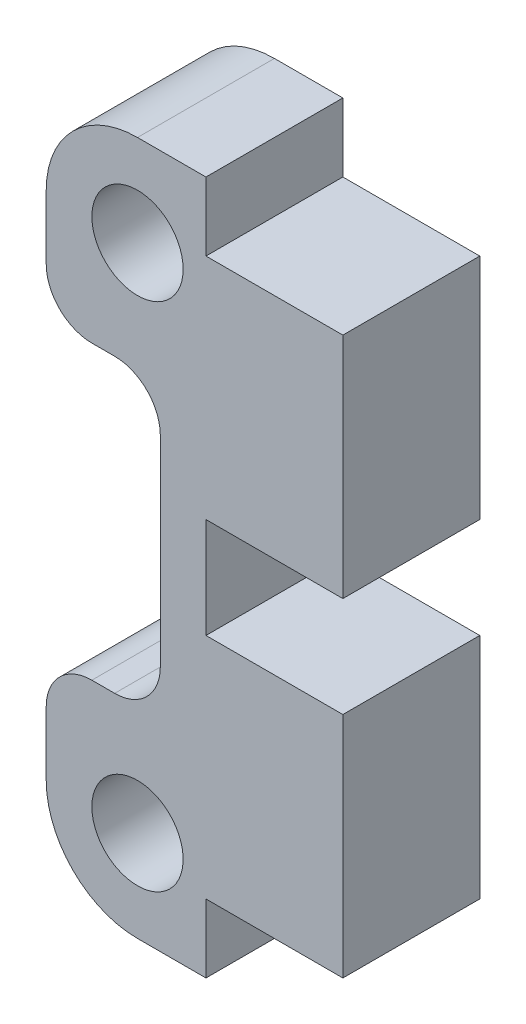
ISO-10303-21;
HEADER;
FILE_DESCRIPTION(('STEP AP214'),'2;1');
FILE_NAME('part.step','',(''),(''),'','','');
FILE_SCHEMA(('AUTOMOTIVE_DESIGN { 1 0 10303 214 1 1 1 1 }'));
ENDSEC;
DATA;
#1=APPLICATION_CONTEXT('core data for automotive mechanical design processes');
#2=APPLICATION_PROTOCOL_DEFINITION('international standard','automotive_design',2000,#1);
#3=PRODUCT_CONTEXT('',#1,'mechanical');
#4=PRODUCT('Part','Part','',(#3));
#5=PRODUCT_RELATED_PRODUCT_CATEGORY('part','',(#4));
#6=PRODUCT_DEFINITION_FORMATION('','',#4);
#7=PRODUCT_DEFINITION_CONTEXT('part definition',#1,'design');
#8=PRODUCT_DEFINITION('design','',#6,#7);
#9=PRODUCT_DEFINITION_SHAPE('','',#8);
#10=(LENGTH_UNIT() NAMED_UNIT(*) SI_UNIT(.MILLI.,.METRE.));
#11=(NAMED_UNIT(*) PLANE_ANGLE_UNIT() SI_UNIT($,.RADIAN.));
#12=(NAMED_UNIT(*) SI_UNIT($,.STERADIAN.) SOLID_ANGLE_UNIT());
#13=UNCERTAINTY_MEASURE_WITH_UNIT(LENGTH_MEASURE(1.E-05),#10,'distance_accuracy_value','');
#14=(GEOMETRIC_REPRESENTATION_CONTEXT(3) GLOBAL_UNCERTAINTY_ASSIGNED_CONTEXT((#13)) GLOBAL_UNIT_ASSIGNED_CONTEXT((#10,
#11,#12)) REPRESENTATION_CONTEXT('',''));
#15=CARTESIAN_POINT('',(0.,0.,0.));
#16=DIRECTION('',(0.,0.,1.));
#17=DIRECTION('',(1.,0.,0.));
#18=AXIS2_PLACEMENT_3D('',#15,#16,#17);
#19=CARTESIAN_POINT('',(-8.9997392156855,11.2,6.));
#20=DIRECTION('',(0.,0.,-1.));
#21=DIRECTION('',(-1.,0.,0.));
#22=AXIS2_PLACEMENT_3D('',#19,#20,#21);
#23=PLANE('',#22);
#24=DIRECTION('',(1.,-3.32597357193477E-12,0.));
#25=VECTOR('',#24,1.);
#26=CARTESIAN_POINT('',(0.,2.2,6.));
#27=LINE('',#26,#25);
#28=CARTESIAN_POINT('',(-5.9997392156855,2.2,6.));
#29=VERTEX_POINT('',#28);
#30=CARTESIAN_POINT('',(0.00026078431449787,2.2,6.));
#31=VERTEX_POINT('',#30);
#32=EDGE_CURVE('E50',#29,#31,#27,.T.);
#33=ORIENTED_EDGE('',*,*,#32,.T.);
#34=DIRECTION('',(0.,1.,0.));
#35=VECTOR('',#34,1.);
#36=CARTESIAN_POINT('',(0.00026078431449787,2.2,6.));
#37=LINE('',#36,#35);
#38=CARTESIAN_POINT('',(0.00026078431449787,12.2,6.));
#39=VERTEX_POINT('',#38);
#40=EDGE_CURVE('E135',#31,#39,#37,.T.);
#41=ORIENTED_EDGE('',*,*,#40,.T.);
#42=DIRECTION('',(-1.,0.,0.));
#43=VECTOR('',#42,1.);
#44=CARTESIAN_POINT('',(0.00026078431449787,12.2,6.));
#45=LINE('',#44,#43);
#46=CARTESIAN_POINT('',(-5.9997392156855,12.2,6.));
#47=VERTEX_POINT('',#46);
#48=EDGE_CURVE('E316',#39,#47,#45,.T.);
#49=ORIENTED_EDGE('',*,*,#48,.T.);
#50=DIRECTION('',(0.,1.,0.));
#51=VECTOR('',#50,1.);
#52=CARTESIAN_POINT('',(-5.9997392156855,12.2,6.));
#53=LINE('',#52,#51);
#54=CARTESIAN_POINT('',(-5.9997392156855,15.2,6.));
#55=VERTEX_POINT('',#54);
#56=EDGE_CURVE('E336',#47,#55,#53,.T.);
#57=ORIENTED_EDGE('',*,*,#56,.T.);
#58=DIRECTION('',(-1.,0.,0.));
#59=VECTOR('',#58,1.);
#60=CARTESIAN_POINT('',(-8.9997392156855,15.2,6.));
#61=LINE('',#60,#59);
#62=CARTESIAN_POINT('',(-8.9997392156855,15.2,6.));
#63=VERTEX_POINT('',#62);
#64=EDGE_CURVE('E333',#55,#63,#61,.T.);
#65=ORIENTED_EDGE('',*,*,#64,.T.);
#66=CARTESIAN_POINT('',(-8.9997392156855,11.2,6.));
#67=DIRECTION('',(0.,0.,1.));
#68=DIRECTION('',(-1.,0.,0.));
#69=AXIS2_PLACEMENT_3D('',#66,#67,#68);
#70=CIRCLE('',#69,4.);
#71=CARTESIAN_POINT('',(-12.9997392156855,11.2,6.));
#72=VERTEX_POINT('',#71);
#73=EDGE_CURVE('E335',#63,#72,#70,.T.);
#74=ORIENTED_EDGE('',*,*,#73,.T.);
#75=DIRECTION('',(0.,-1.,0.));
#76=VECTOR('',#75,1.);
#77=CARTESIAN_POINT('',(-12.9997392156855,11.2,6.));
#78=LINE('',#77,#76);
#79=CARTESIAN_POINT('',(-12.9997392156855,8.39638009049773,6.));
#80=VERTEX_POINT('',#79);
#81=EDGE_CURVE('E338',#72,#80,#78,.T.);
#82=ORIENTED_EDGE('',*,*,#81,.T.);
#83=CARTESIAN_POINT('',(-10.9997392156855,8.39638009049773,6.));
#84=DIRECTION('',(0.,0.,1.));
#85=DIRECTION('',(1.,0.,0.));
#86=AXIS2_PLACEMENT_3D('',#83,#84,#85);
#87=CIRCLE('',#86,2.);
#88=CARTESIAN_POINT('',(-10.9997392156855,6.39638009049773,6.));
#89=VERTEX_POINT('',#88);
#90=EDGE_CURVE('E344',#80,#89,#87,.T.);
#91=ORIENTED_EDGE('',*,*,#90,.T.);
#92=DIRECTION('',(1.,0.,0.));
#93=VECTOR('',#92,1.);
#94=CARTESIAN_POINT('',(-10.9997392156855,6.39638009049773,6.));
#95=LINE('',#94,#93);
#96=CARTESIAN_POINT('',(-10.,6.39638009049773,6.));
#97=VERTEX_POINT('',#96);
#98=EDGE_CURVE('E346',#89,#97,#95,.T.);
#99=ORIENTED_EDGE('',*,*,#98,.T.);
#100=CARTESIAN_POINT('',(-10.,4.39638009049773,6.));
#101=DIRECTION('',(0.,0.,-1.));
#102=DIRECTION('',(-1.,0.,0.));
#103=AXIS2_PLACEMENT_3D('',#100,#101,#102);
#104=CIRCLE('',#103,2.);
#105=CARTESIAN_POINT('',(-8.,4.39638009049772,6.));
#106=VERTEX_POINT('',#105);
#107=EDGE_CURVE('E348',#97,#106,#104,.T.);
#108=ORIENTED_EDGE('',*,*,#107,.T.);
#109=DIRECTION('',(0.,-1.,0.));
#110=VECTOR('',#109,1.);
#111=CARTESIAN_POINT('',(-8.,4.39638009049772,6.));
#112=LINE('',#111,#110);
#113=CARTESIAN_POINT('',(-8.,-4.39638009049772,6.));
#114=VERTEX_POINT('',#113);
#115=EDGE_CURVE('E350',#106,#114,#112,.T.);
#116=ORIENTED_EDGE('',*,*,#115,.T.);
#117=CARTESIAN_POINT('',(-10.,-4.39638009049773,6.));
#118=DIRECTION('',(0.,0.,-1.));
#119=DIRECTION('',(1.,0.,0.));
#120=AXIS2_PLACEMENT_3D('',#117,#118,#119);
#121=CIRCLE('',#120,2.);
#122=CARTESIAN_POINT('',(-10.,-6.39638009049773,6.));
#123=VERTEX_POINT('',#122);
#124=EDGE_CURVE('E352',#114,#123,#121,.T.);
#125=ORIENTED_EDGE('',*,*,#124,.T.);
#126=DIRECTION('',(-1.,0.,0.));
#127=VECTOR('',#126,1.);
#128=CARTESIAN_POINT('',(-10.9997392156855,-6.39638009049773,6.));
#129=LINE('',#128,#127);
#130=CARTESIAN_POINT('',(-10.9997392156855,-6.39638009049773,6.));
#131=VERTEX_POINT('',#130);
#132=EDGE_CURVE('E354',#123,#131,#129,.T.);
#133=ORIENTED_EDGE('',*,*,#132,.T.);
#134=CARTESIAN_POINT('',(-10.9997392156855,-8.39638009049773,6.));
#135=DIRECTION('',(0.,0.,1.));
#136=DIRECTION('',(-1.,0.,0.));
#137=AXIS2_PLACEMENT_3D('',#134,#135,#136);
#138=CIRCLE('',#137,2.);
#139=CARTESIAN_POINT('',(-12.9997392156855,-8.39638009049773,6.));
#140=VERTEX_POINT('',#139);
#141=EDGE_CURVE('E356',#131,#140,#138,.T.);
#142=ORIENTED_EDGE('',*,*,#141,.T.);
#143=DIRECTION('',(0.,-1.,0.));
#144=VECTOR('',#143,1.);
#145=CARTESIAN_POINT('',(-12.9997392156855,-11.2,6.));
#146=LINE('',#145,#144);
#147=CARTESIAN_POINT('',(-12.9997392156855,-11.2,6.));
#148=VERTEX_POINT('',#147);
#149=EDGE_CURVE('E358',#140,#148,#146,.T.);
#150=ORIENTED_EDGE('',*,*,#149,.T.);
#151=CARTESIAN_POINT('',(-8.9997392156855,-11.2,6.));
#152=DIRECTION('',(0.,0.,1.));
#153=DIRECTION('',(1.,0.,0.));
#154=AXIS2_PLACEMENT_3D('',#151,#152,#153);
#155=CIRCLE('',#154,4.);
#156=CARTESIAN_POINT('',(-8.9997392156855,-15.2,6.));
#157=VERTEX_POINT('',#156);
#158=EDGE_CURVE('E360',#148,#157,#155,.T.);
#159=ORIENTED_EDGE('',*,*,#158,.T.);
#160=DIRECTION('',(1.,0.,0.));
#161=VECTOR('',#160,1.);
#162=CARTESIAN_POINT('',(-8.9997392156855,-15.2,6.));
#163=LINE('',#162,#161);
#164=CARTESIAN_POINT('',(-5.9997392156855,-15.2,6.));
#165=VERTEX_POINT('',#164);
#166=EDGE_CURVE('E362',#157,#165,#163,.T.);
#167=ORIENTED_EDGE('',*,*,#166,.T.);
#168=DIRECTION('',(0.,1.,0.));
#169=VECTOR('',#168,1.);
#170=CARTESIAN_POINT('',(-5.9997392156855,-12.2,6.));
#171=LINE('',#170,#169);
#172=CARTESIAN_POINT('',(-5.9997392156855,-12.2,6.));
#173=VERTEX_POINT('',#172);
#174=EDGE_CURVE('E364',#165,#173,#171,.T.);
#175=ORIENTED_EDGE('',*,*,#174,.T.);
#176=DIRECTION('',(1.,0.,0.));
#177=VECTOR('',#176,1.);
#178=CARTESIAN_POINT('',(0.00026078431449787,-12.2,6.));
#179=LINE('',#178,#177);
#180=CARTESIAN_POINT('',(0.00026078431449787,-12.2,6.));
#181=VERTEX_POINT('',#180);
#182=EDGE_CURVE('E197',#173,#181,#179,.T.);
#183=ORIENTED_EDGE('',*,*,#182,.T.);
#184=DIRECTION('',(0.,1.,0.));
#185=VECTOR('',#184,1.);
#186=CARTESIAN_POINT('',(0.00026078431449787,-2.2,6.));
#187=LINE('',#186,#185);
#188=CARTESIAN_POINT('',(0.00026078431449787,-2.2,6.));
#189=VERTEX_POINT('',#188);
#190=EDGE_CURVE('E191',#181,#189,#187,.T.);
#191=ORIENTED_EDGE('',*,*,#190,.T.);
#192=DIRECTION('',(-1.,-3.32597357193477E-12,0.));
#193=VECTOR('',#192,1.);
#194=CARTESIAN_POINT('',(0.,-2.2,6.));
#195=LINE('',#194,#193);
#196=CARTESIAN_POINT('',(-5.9997392156855,-2.2,6.));
#197=VERTEX_POINT('',#196);
#198=EDGE_CURVE('E195',#189,#197,#195,.T.);
#199=ORIENTED_EDGE('',*,*,#198,.T.);
#200=DIRECTION('',(0.,1.,0.));
#201=VECTOR('',#200,1.);
#202=CARTESIAN_POINT('',(-5.9997392156855,2.2,6.));
#203=LINE('',#202,#201);
#204=EDGE_CURVE('E212',#197,#29,#203,.T.);
#205=ORIENTED_EDGE('',*,*,#204,.T.);
#206=EDGE_LOOP('',(#33,#41,#49,#57,#65,#74,#82,#91,#99,#108,#116,#125,#133,#142,#150,#159,#167,
#175,#183,#191,#199,#205));
#207=FACE_BOUND('',#206,.T.);
#208=CARTESIAN_POINT('',(-8.9997392156855,11.2,6.));
#209=DIRECTION('',(0.,0.,1.));
#210=DIRECTION('',(1.,0.,0.));
#211=AXIS2_PLACEMENT_3D('',#208,#209,#210);
#212=CIRCLE('',#211,2.);
#213=CARTESIAN_POINT('',(-6.9997392156855,11.2,6.));
#214=VERTEX_POINT('',#213);
#215=EDGE_CURVE('E221',#214,#214,#212,.T.);
#216=ORIENTED_EDGE('',*,*,#215,.F.);
#217=EDGE_LOOP('',(#216));
#218=FACE_BOUND('',#217,.T.);
#219=CARTESIAN_POINT('',(-8.9997392156855,-11.2,6.));
#220=DIRECTION('',(0.,0.,1.));
#221=DIRECTION('',(-1.,0.,0.));
#222=AXIS2_PLACEMENT_3D('',#219,#220,#221);
#223=CIRCLE('',#222,2.);
#224=CARTESIAN_POINT('',(-10.9997392156855,-11.2,6.));
#225=VERTEX_POINT('',#224);
#226=EDGE_CURVE('E383',#225,#225,#223,.T.);
#227=ORIENTED_EDGE('',*,*,#226,.F.);
#228=EDGE_LOOP('',(#227));
#229=FACE_BOUND('',#228,.T.);
#230=ADVANCED_FACE('F33',(#207,#218,#229),#23,.F.);
#231=CARTESIAN_POINT('',(-8.9997392156855,11.2,0.));
#232=DIRECTION('',(0.,0.,-1.));
#233=DIRECTION('',(-1.,0.,0.));
#234=AXIS2_PLACEMENT_3D('',#231,#232,#233);
#235=PLANE('',#234);
#236=CARTESIAN_POINT('',(-8.9997392156855,11.2,0.));
#237=DIRECTION('',(0.,0.,1.));
#238=DIRECTION('',(1.,0.,0.));
#239=AXIS2_PLACEMENT_3D('',#236,#237,#238);
#240=CIRCLE('',#239,2.);
#241=CARTESIAN_POINT('',(-6.9997392156855,11.2,0.));
#242=VERTEX_POINT('',#241);
#243=EDGE_CURVE('E380',#242,#242,#240,.T.);
#244=ORIENTED_EDGE('',*,*,#243,.T.);
#245=EDGE_LOOP('',(#244));
#246=FACE_BOUND('',#245,.T.);
#247=DIRECTION('',(0.,1.,0.));
#248=VECTOR('',#247,1.);
#249=CARTESIAN_POINT('',(0.00026078431449787,2.2,0.));
#250=LINE('',#249,#248);
#251=CARTESIAN_POINT('',(0.00026078431449787,2.2,0.));
#252=VERTEX_POINT('',#251);
#253=CARTESIAN_POINT('',(0.00026078431449787,12.2,0.));
#254=VERTEX_POINT('',#253);
#255=EDGE_CURVE('E218',#252,#254,#250,.T.);
#256=ORIENTED_EDGE('',*,*,#255,.F.);
#257=DIRECTION('',(1.,0.,0.));
#258=VECTOR('',#257,1.);
#259=CARTESIAN_POINT('',(0.,2.2,0.));
#260=LINE('',#259,#258);
#261=CARTESIAN_POINT('',(-5.9997392156855,2.2,0.));
#262=VERTEX_POINT('',#261);
#263=EDGE_CURVE('E258',#262,#252,#260,.T.);
#264=ORIENTED_EDGE('',*,*,#263,.F.);
#265=DIRECTION('',(0.,1.,0.));
#266=VECTOR('',#265,1.);
#267=CARTESIAN_POINT('',(-5.9997392156855,2.2,0.));
#268=LINE('',#267,#266);
#269=CARTESIAN_POINT('',(-5.9997392156855,-2.2,0.));
#270=VERTEX_POINT('',#269);
#271=EDGE_CURVE('E128',#270,#262,#268,.T.);
#272=ORIENTED_EDGE('',*,*,#271,.F.);
#273=DIRECTION('',(-1.,0.,0.));
#274=VECTOR('',#273,1.);
#275=CARTESIAN_POINT('',(0.,-2.2,0.));
#276=LINE('',#275,#274);
#277=CARTESIAN_POINT('',(0.00026078431449787,-2.2,0.));
#278=VERTEX_POINT('',#277);
#279=EDGE_CURVE('E121',#278,#270,#276,.T.);
#280=ORIENTED_EDGE('',*,*,#279,.F.);
#281=DIRECTION('',(0.,1.,0.));
#282=VECTOR('',#281,1.);
#283=CARTESIAN_POINT('',(0.00026078431449787,-2.2,0.));
#284=LINE('',#283,#282);
#285=CARTESIAN_POINT('',(0.00026078431449787,-12.2,0.));
#286=VERTEX_POINT('',#285);
#287=EDGE_CURVE('E206',#286,#278,#284,.T.);
#288=ORIENTED_EDGE('',*,*,#287,.F.);
#289=DIRECTION('',(1.,0.,0.));
#290=VECTOR('',#289,1.);
#291=CARTESIAN_POINT('',(0.00026078431449787,-12.2,0.));
#292=LINE('',#291,#290);
#293=CARTESIAN_POINT('',(-5.9997392156855,-12.2,0.));
#294=VERTEX_POINT('',#293);
#295=EDGE_CURVE('E253',#294,#286,#292,.T.);
#296=ORIENTED_EDGE('',*,*,#295,.F.);
#297=DIRECTION('',(0.,1.,0.));
#298=VECTOR('',#297,1.);
#299=CARTESIAN_POINT('',(-5.9997392156855,-12.2,0.));
#300=LINE('',#299,#298);
#301=CARTESIAN_POINT('',(-5.9997392156855,-15.2,0.));
#302=VERTEX_POINT('',#301);
#303=EDGE_CURVE('E251',#302,#294,#300,.T.);
#304=ORIENTED_EDGE('',*,*,#303,.F.);
#305=DIRECTION('',(1.,0.,0.));
#306=VECTOR('',#305,1.);
#307=CARTESIAN_POINT('',(-8.9997392156855,-15.2,0.));
#308=LINE('',#307,#306);
#309=CARTESIAN_POINT('',(-8.9997392156855,-15.2,0.));
#310=VERTEX_POINT('',#309);
#311=EDGE_CURVE('E249',#310,#302,#308,.T.);
#312=ORIENTED_EDGE('',*,*,#311,.F.);
#313=CARTESIAN_POINT('',(-8.9997392156855,-11.2,0.));
#314=DIRECTION('',(0.,0.,1.));
#315=DIRECTION('',(1.,0.,0.));
#316=AXIS2_PLACEMENT_3D('',#313,#314,#315);
#317=CIRCLE('',#316,4.);
#318=CARTESIAN_POINT('',(-12.9997392156855,-11.2,0.));
#319=VERTEX_POINT('',#318);
#320=EDGE_CURVE('E247',#319,#310,#317,.T.);
#321=ORIENTED_EDGE('',*,*,#320,.F.);
#322=DIRECTION('',(0.,-1.,0.));
#323=VECTOR('',#322,1.);
#324=CARTESIAN_POINT('',(-12.9997392156855,-11.2,0.));
#325=LINE('',#324,#323);
#326=CARTESIAN_POINT('',(-12.9997392156855,-8.39638009049773,0.));
#327=VERTEX_POINT('',#326);
#328=EDGE_CURVE('E245',#327,#319,#325,.T.);
#329=ORIENTED_EDGE('',*,*,#328,.F.);
#330=CARTESIAN_POINT('',(-10.9997392156855,-8.39638009049773,0.));
#331=DIRECTION('',(0.,0.,1.));
#332=DIRECTION('',(-1.,0.,0.));
#333=AXIS2_PLACEMENT_3D('',#330,#331,#332);
#334=CIRCLE('',#333,2.);
#335=CARTESIAN_POINT('',(-10.9997392156855,-6.39638009049773,0.));
#336=VERTEX_POINT('',#335);
#337=EDGE_CURVE('E243',#336,#327,#334,.T.);
#338=ORIENTED_EDGE('',*,*,#337,.F.);
#339=DIRECTION('',(-1.,0.,0.));
#340=VECTOR('',#339,1.);
#341=CARTESIAN_POINT('',(-10.9997392156855,-6.39638009049773,0.));
#342=LINE('',#341,#340);
#343=CARTESIAN_POINT('',(-10.,-6.39638009049773,0.));
#344=VERTEX_POINT('',#343);
#345=EDGE_CURVE('E241',#344,#336,#342,.T.);
#346=ORIENTED_EDGE('',*,*,#345,.F.);
#347=CARTESIAN_POINT('',(-10.,-4.39638009049773,0.));
#348=DIRECTION('',(0.,0.,-1.));
#349=DIRECTION('',(1.,0.,0.));
#350=AXIS2_PLACEMENT_3D('',#347,#348,#349);
#351=CIRCLE('',#350,2.);
#352=CARTESIAN_POINT('',(-8.,-4.39638009049772,0.));
#353=VERTEX_POINT('',#352);
#354=EDGE_CURVE('E239',#353,#344,#351,.T.);
#355=ORIENTED_EDGE('',*,*,#354,.F.);
#356=DIRECTION('',(0.,-1.,0.));
#357=VECTOR('',#356,1.);
#358=CARTESIAN_POINT('',(-8.,4.39638009049772,0.));
#359=LINE('',#358,#357);
#360=CARTESIAN_POINT('',(-8.,4.39638009049772,0.));
#361=VERTEX_POINT('',#360);
#362=EDGE_CURVE('E237',#361,#353,#359,.T.);
#363=ORIENTED_EDGE('',*,*,#362,.F.);
#364=CARTESIAN_POINT('',(-10.,4.39638009049773,0.));
#365=DIRECTION('',(0.,0.,-1.));
#366=DIRECTION('',(-1.,0.,0.));
#367=AXIS2_PLACEMENT_3D('',#364,#365,#366);
#368=CIRCLE('',#367,2.);
#369=CARTESIAN_POINT('',(-10.,6.39638009049773,0.));
#370=VERTEX_POINT('',#369);
#371=EDGE_CURVE('E235',#370,#361,#368,.T.);
#372=ORIENTED_EDGE('',*,*,#371,.F.);
#373=DIRECTION('',(1.,0.,0.));
#374=VECTOR('',#373,1.);
#375=CARTESIAN_POINT('',(-10.9997392156855,6.39638009049773,0.));
#376=LINE('',#375,#374);
#377=CARTESIAN_POINT('',(-10.9997392156855,6.39638009049773,0.));
#378=VERTEX_POINT('',#377);
#379=EDGE_CURVE('E233',#378,#370,#376,.T.);
#380=ORIENTED_EDGE('',*,*,#379,.F.);
#381=CARTESIAN_POINT('',(-10.9997392156855,8.39638009049773,0.));
#382=DIRECTION('',(0.,0.,1.));
#383=DIRECTION('',(1.,0.,0.));
#384=AXIS2_PLACEMENT_3D('',#381,#382,#383);
#385=CIRCLE('',#384,2.);
#386=CARTESIAN_POINT('',(-12.9997392156855,8.39638009049773,0.));
#387=VERTEX_POINT('',#386);
#388=EDGE_CURVE('E231',#387,#378,#385,.T.);
#389=ORIENTED_EDGE('',*,*,#388,.F.);
#390=DIRECTION('',(0.,-1.,0.));
#391=VECTOR('',#390,1.);
#392=CARTESIAN_POINT('',(-12.9997392156855,11.2,0.));
#393=LINE('',#392,#391);
#394=CARTESIAN_POINT('',(-12.9997392156855,11.2,0.));
#395=VERTEX_POINT('',#394);
#396=EDGE_CURVE('E229',#395,#387,#393,.T.);
#397=ORIENTED_EDGE('',*,*,#396,.F.);
#398=CARTESIAN_POINT('',(-8.9997392156855,11.2,0.));
#399=DIRECTION('',(0.,0.,1.));
#400=DIRECTION('',(-1.,0.,0.));
#401=AXIS2_PLACEMENT_3D('',#398,#399,#400);
#402=CIRCLE('',#401,4.);
#403=CARTESIAN_POINT('',(-8.9997392156855,15.2,0.));
#404=VERTEX_POINT('',#403);
#405=EDGE_CURVE('E227',#404,#395,#402,.T.);
#406=ORIENTED_EDGE('',*,*,#405,.F.);
#407=DIRECTION('',(-1.,0.,0.));
#408=VECTOR('',#407,1.);
#409=CARTESIAN_POINT('',(-8.9997392156855,15.2,0.));
#410=LINE('',#409,#408);
#411=CARTESIAN_POINT('',(-5.9997392156855,15.2,0.));
#412=VERTEX_POINT('',#411);
#413=EDGE_CURVE('E225',#412,#404,#410,.T.);
#414=ORIENTED_EDGE('',*,*,#413,.F.);
#415=DIRECTION('',(0.,1.,0.));
#416=VECTOR('',#415,1.);
#417=CARTESIAN_POINT('',(-5.9997392156855,12.2,0.));
#418=LINE('',#417,#416);
#419=CARTESIAN_POINT('',(-5.9997392156855,12.2,0.));
#420=VERTEX_POINT('',#419);
#421=EDGE_CURVE('E223',#420,#412,#418,.T.);
#422=ORIENTED_EDGE('',*,*,#421,.F.);
#423=DIRECTION('',(-1.,0.,0.));
#424=VECTOR('',#423,1.);
#425=CARTESIAN_POINT('',(0.00026078431449787,12.2,0.));
#426=LINE('',#425,#424);
#427=EDGE_CURVE('E220',#254,#420,#426,.T.);
#428=ORIENTED_EDGE('',*,*,#427,.F.);
#429=EDGE_LOOP('',(#256,#264,#272,#280,#288,#296,#304,#312,#321,#329,#338,#346,#355,#363,#372,
#380,#389,#397,#406,#414,#422,#428));
#430=FACE_BOUND('',#429,.T.);
#431=CARTESIAN_POINT('',(-8.9997392156855,-11.2,0.));
#432=DIRECTION('',(0.,0.,1.));
#433=DIRECTION('',(-1.,0.,0.));
#434=AXIS2_PLACEMENT_3D('',#431,#432,#433);
#435=CIRCLE('',#434,2.);
#436=CARTESIAN_POINT('',(-10.9997392156855,-11.2,0.));
#437=VERTEX_POINT('',#436);
#438=EDGE_CURVE('E386',#437,#437,#435,.T.);
#439=ORIENTED_EDGE('',*,*,#438,.T.);
#440=EDGE_LOOP('',(#439));
#441=FACE_BOUND('',#440,.T.);
#442=ADVANCED_FACE('F320',(#246,#430,#441),#235,.T.);
#443=CARTESIAN_POINT('',(0.00026078431449787,2.2,6.));
#444=DIRECTION('',(-1.,0.,0.));
#445=DIRECTION('',(0.,0.,1.));
#446=AXIS2_PLACEMENT_3D('',#443,#444,#445);
#447=PLANE('',#446);
#448=ORIENTED_EDGE('',*,*,#255,.T.);
#449=DIRECTION('',(0.,0.,-1.));
#450=VECTOR('',#449,1.);
#451=CARTESIAN_POINT('',(0.00026078431449787,12.2,6.));
#452=LINE('',#451,#450);
#453=EDGE_CURVE('E42',#39,#254,#452,.T.);
#454=ORIENTED_EDGE('',*,*,#453,.F.);
#455=ORIENTED_EDGE('',*,*,#40,.F.);
#456=DIRECTION('',(0.,0.,-1.));
#457=VECTOR('',#456,1.);
#458=CARTESIAN_POINT('',(0.00026078431449787,2.2,6.));
#459=LINE('',#458,#457);
#460=EDGE_CURVE('E11',#31,#252,#459,.T.);
#461=ORIENTED_EDGE('',*,*,#460,.T.);
#462=EDGE_LOOP('',(#448,#454,#455,#461));
#463=FACE_BOUND('',#462,.T.);
#464=ADVANCED_FACE('F35',(#463),#447,.F.);
#465=CARTESIAN_POINT('',(0.00026078431449787,12.2,6.));
#466=DIRECTION('',(0.,-1.,0.));
#467=DIRECTION('',(0.,0.,-1.));
#468=AXIS2_PLACEMENT_3D('',#465,#466,#467);
#469=PLANE('',#468);
#470=ORIENTED_EDGE('',*,*,#427,.T.);
#471=DIRECTION('',(0.,0.,-1.));
#472=VECTOR('',#471,1.);
#473=CARTESIAN_POINT('',(-5.9997392156855,12.2,6.));
#474=LINE('',#473,#472);
#475=EDGE_CURVE('E308',#47,#420,#474,.T.);
#476=ORIENTED_EDGE('',*,*,#475,.F.);
#477=ORIENTED_EDGE('',*,*,#48,.F.);
#478=ORIENTED_EDGE('',*,*,#453,.T.);
#479=EDGE_LOOP('',(#470,#476,#477,#478));
#480=FACE_BOUND('',#479,.T.);
#481=ADVANCED_FACE('F314',(#480),#469,.F.);
#482=CARTESIAN_POINT('',(-5.9997392156855,12.2,6.));
#483=DIRECTION('',(-1.,0.,0.));
#484=DIRECTION('',(0.,0.,1.));
#485=AXIS2_PLACEMENT_3D('',#482,#483,#484);
#486=PLANE('',#485);
#487=ORIENTED_EDGE('',*,*,#421,.T.);
#488=DIRECTION('',(0.,0.,-1.));
#489=VECTOR('',#488,1.);
#490=CARTESIAN_POINT('',(-5.9997392156855,15.2,6.));
#491=LINE('',#490,#489);
#492=EDGE_CURVE('E305',#55,#412,#491,.T.);
#493=ORIENTED_EDGE('',*,*,#492,.F.);
#494=ORIENTED_EDGE('',*,*,#56,.F.);
#495=ORIENTED_EDGE('',*,*,#475,.T.);
#496=EDGE_LOOP('',(#487,#493,#494,#495));
#497=FACE_BOUND('',#496,.T.);
#498=ADVANCED_FACE('F327',(#497),#486,.F.);
#499=CARTESIAN_POINT('',(-8.9997392156855,15.2,6.));
#500=DIRECTION('',(0.,-1.,0.));
#501=DIRECTION('',(1.,0.,0.));
#502=AXIS2_PLACEMENT_3D('',#499,#500,#501);
#503=PLANE('',#502);
#504=ORIENTED_EDGE('',*,*,#413,.T.);
#505=DIRECTION('',(0.,0.,-1.));
#506=VECTOR('',#505,1.);
#507=CARTESIAN_POINT('',(-8.9997392156855,15.2,6.));
#508=LINE('',#507,#506);
#509=EDGE_CURVE('E302',#63,#404,#508,.T.);
#510=ORIENTED_EDGE('',*,*,#509,.F.);
#511=ORIENTED_EDGE('',*,*,#64,.F.);
#512=ORIENTED_EDGE('',*,*,#492,.T.);
#513=EDGE_LOOP('',(#504,#510,#511,#512));
#514=FACE_BOUND('',#513,.T.);
#515=ADVANCED_FACE('F331',(#514),#503,.F.);
#516=CARTESIAN_POINT('',(-8.9997392156855,11.2,6.));
#517=DIRECTION('',(0.,0.,-1.));
#518=DIRECTION('',(-1.,0.,0.));
#519=AXIS2_PLACEMENT_3D('',#516,#517,#518);
#520=CYLINDRICAL_SURFACE('',#519,4.);
#521=ORIENTED_EDGE('',*,*,#405,.T.);
#522=DIRECTION('',(0.,0.,-1.));
#523=VECTOR('',#522,1.);
#524=CARTESIAN_POINT('',(-12.9997392156855,11.2,6.));
#525=LINE('',#524,#523);
#526=EDGE_CURVE('E299',#72,#395,#525,.T.);
#527=ORIENTED_EDGE('',*,*,#526,.F.);
#528=ORIENTED_EDGE('',*,*,#73,.F.);
#529=ORIENTED_EDGE('',*,*,#509,.T.);
#530=EDGE_LOOP('',(#521,#527,#528,#529));
#531=FACE_BOUND('',#530,.T.);
#532=ADVANCED_FACE('F461',(#531),#520,.T.);
#533=CARTESIAN_POINT('',(-12.9997392156855,11.2,6.));
#534=DIRECTION('',(1.,0.,0.));
#535=DIRECTION('',(0.,0.,-1.));
#536=AXIS2_PLACEMENT_3D('',#533,#534,#535);
#537=PLANE('',#536);
#538=ORIENTED_EDGE('',*,*,#396,.T.);
#539=DIRECTION('',(0.,0.,-1.));
#540=VECTOR('',#539,1.);
#541=CARTESIAN_POINT('',(-12.9997392156855,8.39638009049773,6.));
#542=LINE('',#541,#540);
#543=EDGE_CURVE('E296',#80,#387,#542,.T.);
#544=ORIENTED_EDGE('',*,*,#543,.F.);
#545=ORIENTED_EDGE('',*,*,#81,.F.);
#546=ORIENTED_EDGE('',*,*,#526,.T.);
#547=EDGE_LOOP('',(#538,#544,#545,#546));
#548=FACE_BOUND('',#547,.T.);
#549=ADVANCED_FACE('F457',(#548),#537,.F.);
#550=CARTESIAN_POINT('',(-10.9997392156855,8.39638009049773,6.));
#551=DIRECTION('',(0.,0.,-1.));
#552=DIRECTION('',(-1.,0.,0.));
#553=AXIS2_PLACEMENT_3D('',#550,#551,#552);
#554=CYLINDRICAL_SURFACE('',#553,2.);
#555=ORIENTED_EDGE('',*,*,#388,.T.);
#556=DIRECTION('',(0.,0.,-1.));
#557=VECTOR('',#556,1.);
#558=CARTESIAN_POINT('',(-10.9997392156855,6.39638009049773,6.));
#559=LINE('',#558,#557);
#560=EDGE_CURVE('E293',#89,#378,#559,.T.);
#561=ORIENTED_EDGE('',*,*,#560,.F.);
#562=ORIENTED_EDGE('',*,*,#90,.F.);
#563=ORIENTED_EDGE('',*,*,#543,.T.);
#564=EDGE_LOOP('',(#555,#561,#562,#563));
#565=FACE_BOUND('',#564,.T.);
#566=ADVANCED_FACE('F453',(#565),#554,.T.);
#567=CARTESIAN_POINT('',(-10.9997392156855,6.39638009049773,6.));
#568=DIRECTION('',(0.,1.,0.));
#569=DIRECTION('',(0.,0.,1.));
#570=AXIS2_PLACEMENT_3D('',#567,#568,#569);
#571=PLANE('',#570);
#572=ORIENTED_EDGE('',*,*,#379,.T.);
#573=DIRECTION('',(0.,0.,-1.));
#574=VECTOR('',#573,1.);
#575=CARTESIAN_POINT('',(-10.,6.39638009049773,6.));
#576=LINE('',#575,#574);
#577=EDGE_CURVE('E290',#97,#370,#576,.T.);
#578=ORIENTED_EDGE('',*,*,#577,.F.);
#579=ORIENTED_EDGE('',*,*,#98,.F.);
#580=ORIENTED_EDGE('',*,*,#560,.T.);
#581=EDGE_LOOP('',(#572,#578,#579,#580));
#582=FACE_BOUND('',#581,.T.);
#583=ADVANCED_FACE('F449',(#582),#571,.F.);
#584=CARTESIAN_POINT('',(-10.,4.39638009049773,6.));
#585=DIRECTION('',(0.,0.,-1.));
#586=DIRECTION('',(-1.,0.,0.));
#587=AXIS2_PLACEMENT_3D('',#584,#585,#586);
#588=CYLINDRICAL_SURFACE('',#587,2.);
#589=ORIENTED_EDGE('',*,*,#371,.T.);
#590=DIRECTION('',(0.,0.,-1.));
#591=VECTOR('',#590,1.);
#592=CARTESIAN_POINT('',(-8.,4.39638009049772,6.));
#593=LINE('',#592,#591);
#594=EDGE_CURVE('E287',#106,#361,#593,.T.);
#595=ORIENTED_EDGE('',*,*,#594,.F.);
#596=ORIENTED_EDGE('',*,*,#107,.F.);
#597=ORIENTED_EDGE('',*,*,#577,.T.);
#598=EDGE_LOOP('',(#589,#595,#596,#597));
#599=FACE_BOUND('',#598,.T.);
#600=ADVANCED_FACE('F445',(#599),#588,.F.);
#601=CARTESIAN_POINT('',(-8.,4.39638009049772,6.));
#602=DIRECTION('',(1.,0.,0.));
#603=DIRECTION('',(0.,0.,-1.));
#604=AXIS2_PLACEMENT_3D('',#601,#602,#603);
#605=PLANE('',#604);
#606=ORIENTED_EDGE('',*,*,#362,.T.);
#607=DIRECTION('',(0.,0.,-1.));
#608=VECTOR('',#607,1.);
#609=CARTESIAN_POINT('',(-8.,-4.39638009049772,6.));
#610=LINE('',#609,#608);
#611=EDGE_CURVE('E284',#114,#353,#610,.T.);
#612=ORIENTED_EDGE('',*,*,#611,.F.);
#613=ORIENTED_EDGE('',*,*,#115,.F.);
#614=ORIENTED_EDGE('',*,*,#594,.T.);
#615=EDGE_LOOP('',(#606,#612,#613,#614));
#616=FACE_BOUND('',#615,.T.);
#617=ADVANCED_FACE('F441',(#616),#605,.F.);
#618=CARTESIAN_POINT('',(-10.,-4.39638009049773,6.));
#619=DIRECTION('',(0.,0.,-1.));
#620=DIRECTION('',(-1.,0.,0.));
#621=AXIS2_PLACEMENT_3D('',#618,#619,#620);
#622=CYLINDRICAL_SURFACE('',#621,2.);
#623=ORIENTED_EDGE('',*,*,#354,.T.);
#624=DIRECTION('',(0.,0.,-1.));
#625=VECTOR('',#624,1.);
#626=CARTESIAN_POINT('',(-10.,-6.39638009049773,6.));
#627=LINE('',#626,#625);
#628=EDGE_CURVE('E281',#123,#344,#627,.T.);
#629=ORIENTED_EDGE('',*,*,#628,.F.);
#630=ORIENTED_EDGE('',*,*,#124,.F.);
#631=ORIENTED_EDGE('',*,*,#611,.T.);
#632=EDGE_LOOP('',(#623,#629,#630,#631));
#633=FACE_BOUND('',#632,.T.);
#634=ADVANCED_FACE('F437',(#633),#622,.F.);
#635=CARTESIAN_POINT('',(-10.9997392156855,-6.39638009049773,6.));
#636=DIRECTION('',(0.,-1.,0.));
#637=DIRECTION('',(0.,0.,-1.));
#638=AXIS2_PLACEMENT_3D('',#635,#636,#637);
#639=PLANE('',#638);
#640=ORIENTED_EDGE('',*,*,#345,.T.);
#641=DIRECTION('',(0.,0.,-1.));
#642=VECTOR('',#641,1.);
#643=CARTESIAN_POINT('',(-10.9997392156855,-6.39638009049773,6.));
#644=LINE('',#643,#642);
#645=EDGE_CURVE('E278',#131,#336,#644,.T.);
#646=ORIENTED_EDGE('',*,*,#645,.F.);
#647=ORIENTED_EDGE('',*,*,#132,.F.);
#648=ORIENTED_EDGE('',*,*,#628,.T.);
#649=EDGE_LOOP('',(#640,#646,#647,#648));
#650=FACE_BOUND('',#649,.T.);
#651=ADVANCED_FACE('F433',(#650),#639,.F.);
#652=CARTESIAN_POINT('',(-10.9997392156855,-8.39638009049773,6.));
#653=DIRECTION('',(0.,0.,-1.));
#654=DIRECTION('',(-1.,0.,0.));
#655=AXIS2_PLACEMENT_3D('',#652,#653,#654);
#656=CYLINDRICAL_SURFACE('',#655,2.);
#657=ORIENTED_EDGE('',*,*,#337,.T.);
#658=DIRECTION('',(0.,0.,-1.));
#659=VECTOR('',#658,1.);
#660=CARTESIAN_POINT('',(-12.9997392156855,-8.39638009049773,6.));
#661=LINE('',#660,#659);
#662=EDGE_CURVE('E275',#140,#327,#661,.T.);
#663=ORIENTED_EDGE('',*,*,#662,.F.);
#664=ORIENTED_EDGE('',*,*,#141,.F.);
#665=ORIENTED_EDGE('',*,*,#645,.T.);
#666=EDGE_LOOP('',(#657,#663,#664,#665));
#667=FACE_BOUND('',#666,.T.);
#668=ADVANCED_FACE('F429',(#667),#656,.T.);
#669=CARTESIAN_POINT('',(-12.9997392156855,-11.2,6.));
#670=DIRECTION('',(1.,0.,0.));
#671=DIRECTION('',(0.,0.,-1.));
#672=AXIS2_PLACEMENT_3D('',#669,#670,#671);
#673=PLANE('',#672);
#674=ORIENTED_EDGE('',*,*,#328,.T.);
#675=DIRECTION('',(0.,0.,-1.));
#676=VECTOR('',#675,1.);
#677=CARTESIAN_POINT('',(-12.9997392156855,-11.2,6.));
#678=LINE('',#677,#676);
#679=EDGE_CURVE('E272',#148,#319,#678,.T.);
#680=ORIENTED_EDGE('',*,*,#679,.F.);
#681=ORIENTED_EDGE('',*,*,#149,.F.);
#682=ORIENTED_EDGE('',*,*,#662,.T.);
#683=EDGE_LOOP('',(#674,#680,#681,#682));
#684=FACE_BOUND('',#683,.T.);
#685=ADVANCED_FACE('F425',(#684),#673,.F.);
#686=CARTESIAN_POINT('',(-8.9997392156855,-11.2,6.));
#687=DIRECTION('',(0.,0.,-1.));
#688=DIRECTION('',(-1.,0.,0.));
#689=AXIS2_PLACEMENT_3D('',#686,#687,#688);
#690=CYLINDRICAL_SURFACE('',#689,4.);
#691=ORIENTED_EDGE('',*,*,#320,.T.);
#692=DIRECTION('',(0.,0.,-1.));
#693=VECTOR('',#692,1.);
#694=CARTESIAN_POINT('',(-8.9997392156855,-15.2,6.));
#695=LINE('',#694,#693);
#696=EDGE_CURVE('E269',#157,#310,#695,.T.);
#697=ORIENTED_EDGE('',*,*,#696,.F.);
#698=ORIENTED_EDGE('',*,*,#158,.F.);
#699=ORIENTED_EDGE('',*,*,#679,.T.);
#700=EDGE_LOOP('',(#691,#697,#698,#699));
#701=FACE_BOUND('',#700,.T.);
#702=ADVANCED_FACE('F421',(#701),#690,.T.);
#703=CARTESIAN_POINT('',(-8.9997392156855,-15.2,6.));
#704=DIRECTION('',(0.,1.,0.));
#705=DIRECTION('',(-1.,0.,0.));
#706=AXIS2_PLACEMENT_3D('',#703,#704,#705);
#707=PLANE('',#706);
#708=ORIENTED_EDGE('',*,*,#311,.T.);
#709=DIRECTION('',(0.,0.,-1.));
#710=VECTOR('',#709,1.);
#711=CARTESIAN_POINT('',(-5.9997392156855,-15.2,6.));
#712=LINE('',#711,#710);
#713=EDGE_CURVE('E266',#165,#302,#712,.T.);
#714=ORIENTED_EDGE('',*,*,#713,.F.);
#715=ORIENTED_EDGE('',*,*,#166,.F.);
#716=ORIENTED_EDGE('',*,*,#696,.T.);
#717=EDGE_LOOP('',(#708,#714,#715,#716));
#718=FACE_BOUND('',#717,.T.);
#719=ADVANCED_FACE('F418',(#718),#707,.F.);
#720=CARTESIAN_POINT('',(-5.9997392156855,-12.2,6.));
#721=DIRECTION('',(-1.,0.,0.));
#722=DIRECTION('',(0.,0.,1.));
#723=AXIS2_PLACEMENT_3D('',#720,#721,#722);
#724=PLANE('',#723);
#725=ORIENTED_EDGE('',*,*,#303,.T.);
#726=DIRECTION('',(0.,0.,-1.));
#727=VECTOR('',#726,1.);
#728=CARTESIAN_POINT('',(-5.9997392156855,-12.2,6.));
#729=LINE('',#728,#727);
#730=EDGE_CURVE('E263',#173,#294,#729,.T.);
#731=ORIENTED_EDGE('',*,*,#730,.F.);
#732=ORIENTED_EDGE('',*,*,#174,.F.);
#733=ORIENTED_EDGE('',*,*,#713,.T.);
#734=EDGE_LOOP('',(#725,#731,#732,#733));
#735=FACE_BOUND('',#734,.T.);
#736=ADVANCED_FACE('F370',(#735),#724,.F.);
#737=CARTESIAN_POINT('',(0.00026078431449787,-12.2,6.));
#738=DIRECTION('',(0.,1.,0.));
#739=DIRECTION('',(0.,0.,1.));
#740=AXIS2_PLACEMENT_3D('',#737,#738,#739);
#741=PLANE('',#740);
#742=ORIENTED_EDGE('',*,*,#295,.T.);
#743=DIRECTION('',(0.,0.,-1.));
#744=VECTOR('',#743,1.);
#745=CARTESIAN_POINT('',(0.00026078431449787,-12.2,6.));
#746=LINE('',#745,#744);
#747=EDGE_CURVE('E207',#181,#286,#746,.T.);
#748=ORIENTED_EDGE('',*,*,#747,.F.);
#749=ORIENTED_EDGE('',*,*,#182,.F.);
#750=ORIENTED_EDGE('',*,*,#730,.T.);
#751=EDGE_LOOP('',(#742,#748,#749,#750));
#752=FACE_BOUND('',#751,.T.);
#753=ADVANCED_FACE('F374',(#752),#741,.F.);
#754=CARTESIAN_POINT('',(0.00026078431449787,-2.2,6.));
#755=DIRECTION('',(-1.,0.,0.));
#756=DIRECTION('',(0.,0.,1.));
#757=AXIS2_PLACEMENT_3D('',#754,#755,#756);
#758=PLANE('',#757);
#759=ORIENTED_EDGE('',*,*,#287,.T.);
#760=DIRECTION('',(0.,0.,-1.));
#761=VECTOR('',#760,1.);
#762=CARTESIAN_POINT('',(0.00026078431449787,-2.2,6.));
#763=LINE('',#762,#761);
#764=EDGE_CURVE('E203',#189,#278,#763,.T.);
#765=ORIENTED_EDGE('',*,*,#764,.F.);
#766=ORIENTED_EDGE('',*,*,#190,.F.);
#767=ORIENTED_EDGE('',*,*,#747,.T.);
#768=EDGE_LOOP('',(#759,#765,#766,#767));
#769=FACE_BOUND('',#768,.T.);
#770=ADVANCED_FACE('F204',(#769),#758,.F.);
#771=CARTESIAN_POINT('',(0.,-2.2,6.));
#772=DIRECTION('',(0.,-1.,0.));
#773=DIRECTION('',(0.,0.,-1.));
#774=AXIS2_PLACEMENT_3D('',#771,#772,#773);
#775=PLANE('',#774);
#776=ORIENTED_EDGE('',*,*,#279,.T.);
#777=DIRECTION('',(0.,0.,-1.));
#778=VECTOR('',#777,1.);
#779=CARTESIAN_POINT('',(-5.9997392156855,-2.2,6.));
#780=LINE('',#779,#778);
#781=EDGE_CURVE('E208',#197,#270,#780,.T.);
#782=ORIENTED_EDGE('',*,*,#781,.F.);
#783=ORIENTED_EDGE('',*,*,#198,.F.);
#784=ORIENTED_EDGE('',*,*,#764,.T.);
#785=EDGE_LOOP('',(#776,#782,#783,#784));
#786=FACE_BOUND('',#785,.T.);
#787=ADVANCED_FACE('F210',(#786),#775,.F.);
#788=CARTESIAN_POINT('',(-5.9997392156855,2.2,6.));
#789=DIRECTION('',(-1.,0.,0.));
#790=DIRECTION('',(0.,0.,1.));
#791=AXIS2_PLACEMENT_3D('',#788,#789,#790);
#792=PLANE('',#791);
#793=ORIENTED_EDGE('',*,*,#271,.T.);
#794=DIRECTION('',(0.,0.,-1.));
#795=VECTOR('',#794,1.);
#796=CARTESIAN_POINT('',(-5.9997392156855,2.2,6.));
#797=LINE('',#796,#795);
#798=EDGE_CURVE('E214',#29,#262,#797,.T.);
#799=ORIENTED_EDGE('',*,*,#798,.F.);
#800=ORIENTED_EDGE('',*,*,#204,.F.);
#801=ORIENTED_EDGE('',*,*,#781,.T.);
#802=EDGE_LOOP('',(#793,#799,#800,#801));
#803=FACE_BOUND('',#802,.T.);
#804=ADVANCED_FACE('F376',(#803),#792,.F.);
#805=CARTESIAN_POINT('',(0.,2.2,6.));
#806=DIRECTION('',(0.,1.,0.));
#807=DIRECTION('',(0.,0.,1.));
#808=AXIS2_PLACEMENT_3D('',#805,#806,#807);
#809=PLANE('',#808);
#810=ORIENTED_EDGE('',*,*,#263,.T.);
#811=ORIENTED_EDGE('',*,*,#460,.F.);
#812=ORIENTED_EDGE('',*,*,#32,.F.);
#813=ORIENTED_EDGE('',*,*,#798,.T.);
#814=EDGE_LOOP('',(#810,#811,#812,#813));
#815=FACE_BOUND('',#814,.T.);
#816=ADVANCED_FACE('F375',(#815),#809,.F.);
#817=CARTESIAN_POINT('',(-8.9997392156855,11.2,6.));
#818=DIRECTION('',(0.,0.,-1.));
#819=DIRECTION('',(-1.,0.,0.));
#820=AXIS2_PLACEMENT_3D('',#817,#818,#819);
#821=CYLINDRICAL_SURFACE('',#820,2.);
#822=ORIENTED_EDGE('',*,*,#215,.T.);
#823=EDGE_LOOP('',(#822));
#824=FACE_BOUND('',#823,.T.);
#825=ORIENTED_EDGE('',*,*,#243,.F.);
#826=EDGE_LOOP('',(#825));
#827=FACE_BOUND('',#826,.T.);
#828=ADVANCED_FACE('F403',(#824,#827),#821,.F.);
#829=CARTESIAN_POINT('',(-8.9997392156855,-11.2,6.));
#830=DIRECTION('',(0.,0.,-1.));
#831=DIRECTION('',(-1.,0.,0.));
#832=AXIS2_PLACEMENT_3D('',#829,#830,#831);
#833=CYLINDRICAL_SURFACE('',#832,2.);
#834=ORIENTED_EDGE('',*,*,#226,.T.);
#835=EDGE_LOOP('',(#834));
#836=FACE_BOUND('',#835,.T.);
#837=ORIENTED_EDGE('',*,*,#438,.F.);
#838=EDGE_LOOP('',(#837));
#839=FACE_BOUND('',#838,.T.);
#840=ADVANCED_FACE('F392',(#836,#839),#833,.F.);
#841=CLOSED_SHELL('',(#230,#442,#464,#481,#498,#515,#532,#549,#566,#583,#600,#617,#634,#651,
#668,#685,#702,#719,#736,#753,#770,#787,#804,#816,#828,#840));
#842=MANIFOLD_SOLID_BREP('B2',#841);
#843=ADVANCED_BREP_SHAPE_REPRESENTATION('',(#18,#842),#14);
#844=SHAPE_DEFINITION_REPRESENTATION(#9,#843);
ENDSEC;
END-ISO-10303-21;
